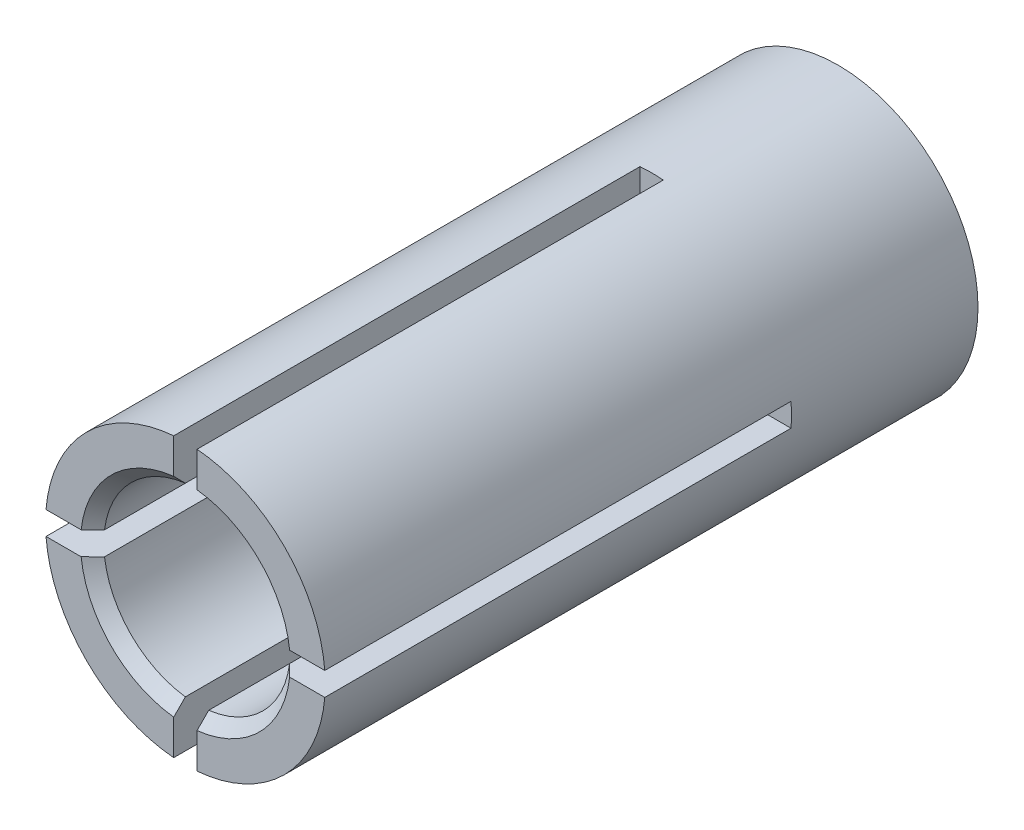
ISO-10303-21;
HEADER;
FILE_DESCRIPTION(('STEP AP214'),'2;1');
FILE_NAME('part.step','',(''),(''),'','','');
FILE_SCHEMA(('AUTOMOTIVE_DESIGN { 1 0 10303 214 1 1 1 1 }'));
ENDSEC;
DATA;
#1=APPLICATION_CONTEXT('core data for automotive mechanical design processes');
#2=APPLICATION_PROTOCOL_DEFINITION('international standard','automotive_design',2000,#1);
#3=PRODUCT_CONTEXT('',#1,'mechanical');
#4=PRODUCT('Part','Part','',(#3));
#5=PRODUCT_RELATED_PRODUCT_CATEGORY('part','',(#4));
#6=PRODUCT_DEFINITION_FORMATION('','',#4);
#7=PRODUCT_DEFINITION_CONTEXT('part definition',#1,'design');
#8=PRODUCT_DEFINITION('design','',#6,#7);
#9=PRODUCT_DEFINITION_SHAPE('','',#8);
#10=(LENGTH_UNIT() NAMED_UNIT(*) SI_UNIT(.MILLI.,.METRE.));
#11=(NAMED_UNIT(*) PLANE_ANGLE_UNIT() SI_UNIT($,.RADIAN.));
#12=(NAMED_UNIT(*) SI_UNIT($,.STERADIAN.) SOLID_ANGLE_UNIT());
#13=UNCERTAINTY_MEASURE_WITH_UNIT(LENGTH_MEASURE(1.E-05),#10,'distance_accuracy_value','');
#14=(GEOMETRIC_REPRESENTATION_CONTEXT(3) GLOBAL_UNCERTAINTY_ASSIGNED_CONTEXT((#13)) GLOBAL_UNIT_ASSIGNED_CONTEXT((#10,
#11,#12)) REPRESENTATION_CONTEXT('',''));
#15=CARTESIAN_POINT('',(0.,0.,0.));
#16=DIRECTION('',(0.,0.,1.));
#17=DIRECTION('',(1.,0.,0.));
#18=AXIS2_PLACEMENT_3D('',#15,#16,#17);
#19=CARTESIAN_POINT('',(0.,0.,14.));
#20=DIRECTION('',(0.,0.,1.));
#21=DIRECTION('',(1.,0.,0.));
#22=AXIS2_PLACEMENT_3D('',#19,#20,#21);
#23=PLANE('',#22);
#24=DIRECTION('',(1.,0.,0.));
#25=VECTOR('',#24,1.);
#26=CARTESIAN_POINT('',(2.98956518577535,-0.25,14.));
#27=LINE('',#26,#25);
#28=CARTESIAN_POINT('',(2.23606797749979,-0.25,14.));
#29=VERTEX_POINT('',#28);
#30=CARTESIAN_POINT('',(2.98956518577535,-0.25,14.));
#31=VERTEX_POINT('',#30);
#32=EDGE_CURVE('E189',#29,#31,#27,.T.);
#33=ORIENTED_EDGE('',*,*,#32,.F.);
#34=CARTESIAN_POINT('',(0.,0.,14.));
#35=DIRECTION('',(0.,0.,1.));
#36=DIRECTION('',(1.,0.,0.));
#37=AXIS2_PLACEMENT_3D('',#34,#35,#36);
#38=CIRCLE('',#37,2.25);
#39=CARTESIAN_POINT('',(0.25,-2.23606797749979,14.));
#40=VERTEX_POINT('',#39);
#41=EDGE_CURVE('E235',#29,#40,#38,.F.);
#42=ORIENTED_EDGE('',*,*,#41,.T.);
#43=DIRECTION('',(0.,1.,0.));
#44=VECTOR('',#43,1.);
#45=CARTESIAN_POINT('',(0.25,-0.25,14.));
#46=LINE('',#45,#44);
#47=CARTESIAN_POINT('',(0.250000000000002,-2.98956518577535,14.));
#48=VERTEX_POINT('',#47);
#49=EDGE_CURVE('E287',#48,#40,#46,.T.);
#50=ORIENTED_EDGE('',*,*,#49,.F.);
#51=CARTESIAN_POINT('',(0.,0.,14.));
#52=DIRECTION('',(0.,0.,1.));
#53=DIRECTION('',(1.,0.,0.));
#54=AXIS2_PLACEMENT_3D('',#51,#52,#53);
#55=CIRCLE('',#54,3.);
#56=EDGE_CURVE('E227',#48,#31,#55,.T.);
#57=ORIENTED_EDGE('',*,*,#56,.T.);
#58=EDGE_LOOP('',(#33,#42,#50,#57));
#59=FACE_BOUND('',#58,.T.);
#60=ADVANCED_FACE('F30',(#59),#23,.T.);
#61=DIRECTION('',(0.,-1.,0.));
#62=VECTOR('',#61,1.);
#63=CARTESIAN_POINT('',(-0.25,-0.25,14.));
#64=LINE('',#63,#62);
#65=CARTESIAN_POINT('',(-0.25,-2.23606797749979,14.));
#66=VERTEX_POINT('',#65);
#67=CARTESIAN_POINT('',(-0.25,-2.98956518577535,14.));
#68=VERTEX_POINT('',#67);
#69=EDGE_CURVE('E394',#66,#68,#64,.T.);
#70=ORIENTED_EDGE('',*,*,#69,.F.);
#71=CARTESIAN_POINT('',(-2.23606797749979,-0.25,14.));
#72=VERTEX_POINT('',#71);
#73=EDGE_CURVE('E239',#66,#72,#38,.F.);
#74=ORIENTED_EDGE('',*,*,#73,.T.);
#75=DIRECTION('',(1.,0.,0.));
#76=VECTOR('',#75,1.);
#77=CARTESIAN_POINT('',(-2.98956518577535,-0.25,14.));
#78=LINE('',#77,#76);
#79=CARTESIAN_POINT('',(-2.98956518577535,-0.249999999999999,14.));
#80=VERTEX_POINT('',#79);
#81=EDGE_CURVE('E392',#80,#72,#78,.T.);
#82=ORIENTED_EDGE('',*,*,#81,.F.);
#83=EDGE_CURVE('E434',#80,#68,#55,.T.);
#84=ORIENTED_EDGE('',*,*,#83,.T.);
#85=EDGE_LOOP('',(#70,#74,#82,#84));
#86=FACE_BOUND('',#85,.T.);
#87=ADVANCED_FACE('F275',(#86),#23,.T.);
#88=DIRECTION('',(-1.,0.,0.));
#89=VECTOR('',#88,1.);
#90=CARTESIAN_POINT('',(-2.98956518577535,0.249999999999998,14.));
#91=LINE('',#90,#89);
#92=CARTESIAN_POINT('',(-2.23606797749979,0.249999999999999,14.));
#93=VERTEX_POINT('',#92);
#94=CARTESIAN_POINT('',(-2.98956518577535,0.249999999999998,14.));
#95=VERTEX_POINT('',#94);
#96=EDGE_CURVE('E412',#93,#95,#91,.T.);
#97=ORIENTED_EDGE('',*,*,#96,.F.);
#98=CARTESIAN_POINT('',(-0.25,2.23606797749979,14.));
#99=VERTEX_POINT('',#98);
#100=EDGE_CURVE('E381',#93,#99,#38,.F.);
#101=ORIENTED_EDGE('',*,*,#100,.T.);
#102=DIRECTION('',(0.,-1.,0.));
#103=VECTOR('',#102,1.);
#104=CARTESIAN_POINT('',(-0.25,0.25,14.));
#105=LINE('',#104,#103);
#106=CARTESIAN_POINT('',(-0.25,2.98956518577535,14.));
#107=VERTEX_POINT('',#106);
#108=EDGE_CURVE('E415',#107,#99,#105,.T.);
#109=ORIENTED_EDGE('',*,*,#108,.F.);
#110=EDGE_CURVE('E226',#107,#95,#55,.T.);
#111=ORIENTED_EDGE('',*,*,#110,.T.);
#112=EDGE_LOOP('',(#97,#101,#109,#111));
#113=FACE_BOUND('',#112,.T.);
#114=ADVANCED_FACE('F268',(#113),#23,.T.);
#115=CARTESIAN_POINT('',(0.,0.,13.75));
#116=DIRECTION('',(0.,0.,1.));
#117=DIRECTION('',(1.,0.,0.));
#118=AXIS2_PLACEMENT_3D('',#115,#116,#117);
#119=CONICAL_SURFACE('',#118,2.,0.785398163397455);
#120=CARTESIAN_POINT('',(0.302741084224424,-0.25,12.1426221645264));
#121=CARTESIAN_POINT('',(0.317960453729847,-0.25,12.1543679730482));
#122=CARTESIAN_POINT('',(0.333014531848367,-0.25,12.1663229463904));
#123=CARTESIAN_POINT('',(0.36285792672978,-0.25,12.190554220147));
#124=CARTESIAN_POINT('',(0.377647290102898,-0.25,12.2028304630369));
#125=CARTESIAN_POINT('',(0.421711584192529,-0.25,12.2399907180696));
#126=CARTESIAN_POINT('',(0.450696505860516,-0.25,12.2652171671053));
#127=CARTESIAN_POINT('',(0.508176291730957,-0.25,12.3161879557759));
#128=CARTESIAN_POINT('',(0.5366714023152,-0.25,12.3419320200088));
#129=CARTESIAN_POINT('',(0.593351685196752,-0.25,12.3937670443241));
#130=CARTESIAN_POINT('',(0.621536809723744,-0.25,12.4198580565411));
#131=CARTESIAN_POINT('',(0.709452963884151,-0.25,12.5018997394878));
#132=CARTESIAN_POINT('',(0.768811177280419,-0.25,12.5582489591398));
#133=CARTESIAN_POINT('',(0.887045822918403,-0.25,12.6714511318724));
#134=CARTESIAN_POINT('',(0.945922240026668,-0.25,12.72830410066));
#135=CARTESIAN_POINT('',(1.12213731279967,-0.25,12.8992872007103));
#136=CARTESIAN_POINT('',(1.23906296186066,-0.25,13.013842641041));
#137=CARTESIAN_POINT('',(1.47257646545155,-0.25,13.2435090676362));
#138=CARTESIAN_POINT('',(1.58916391117353,-0.25,13.3586204674635));
#139=CARTESIAN_POINT('',(1.82209400881993,-0.25,13.5890861029974));
#140=CARTESIAN_POINT('',(1.9384366657381,-0.25,13.7044403336521));
#141=CARTESIAN_POINT('',(2.19822193413989,-0.25,13.9623251721432));
#142=CARTESIAN_POINT('',(2.34162858752974,-0.25,14.104891962737));
#143=CARTESIAN_POINT('',(2.62832290392371,-0.25,14.3901473591601));
#144=CARTESIAN_POINT('',(2.77161056599507,-0.25,14.5328359659267));
#145=CARTESIAN_POINT('',(3.05792402957366,-0.25,14.8181018736583));
#146=CARTESIAN_POINT('',(3.20094992869957,-0.25,14.9606790766729));
#147=CARTESIAN_POINT('',(3.48694883303794,-0.25,15.2458841152313));
#148=CARTESIAN_POINT('',(3.6299218386862,-0.25,15.3885119503382));
#149=CARTESIAN_POINT('',(3.77288046266891,-0.25,15.5311541869631));
#150=B_SPLINE_CURVE_WITH_KNOTS('',3,(#120,#121,#122,#123,#124,#125,#126,#127,#128,#129,#130,
#131,#132,#133,#134,#135,#136,#137,#138,#139,#140,#141,#142,#143,#144,#145,#146,#147,#148,#149),
.UNSPECIFIED.,.F.,.F.,(4,2,2,2,2,2,2,2,2,2,2,2,2,2,4),(0.,0.0576681378172349,0.115326019670359,
0.23058906804333,0.345792332639199,0.461013108618342,0.706541151172434,0.952076876502175,
1.44314347376522,1.93466102702139,2.42616845403975,3.03281229507879,3.63946084754579,
4.24531725391537,4.85116855206024),.UNSPECIFIED.);
#151=CARTESIAN_POINT('',(1.98431348329844,-0.25,13.75));
#152=VERTEX_POINT('',#151);
#153=EDGE_CURVE('E294',#152,#29,#150,.T.);
#154=ORIENTED_EDGE('',*,*,#153,.F.);
#155=CARTESIAN_POINT('',(0.,0.,13.75));
#156=DIRECTION('',(0.,0.,1.));
#157=DIRECTION('',(1.,0.,0.));
#158=AXIS2_PLACEMENT_3D('',#155,#156,#157);
#159=CIRCLE('',#158,2.);
#160=CARTESIAN_POINT('',(0.25,-1.98431348329844,13.75));
#161=VERTEX_POINT('',#160);
#162=EDGE_CURVE('E225',#161,#152,#159,.T.);
#163=ORIENTED_EDGE('',*,*,#162,.F.);
#164=CARTESIAN_POINT('',(0.25,-3.77288046266891,15.5311541869631));
#165=CARTESIAN_POINT('',(0.25,-3.62981802243947,15.3884085007871));
#166=CARTESIAN_POINT('',(0.25,-3.48674127796846,15.245677131242));
#167=CARTESIAN_POINT('',(0.25,-3.20054113992748,14.9602714322271));
#168=CARTESIAN_POINT('',(0.25,-3.05741774821332,14.8175971008963));
#169=CARTESIAN_POINT('',(0.25,-2.77111016330189,14.5323377376306));
#170=CARTESIAN_POINT('',(0.25,-2.62792597750641,14.3897526982675));
#171=CARTESIAN_POINT('',(0.25,-2.34143336691177,14.1046974507362));
#172=CARTESIAN_POINT('',(0.25,-2.19812493795967,13.9622272467398));
#173=CARTESIAN_POINT('',(0.25,-1.98298880509478,13.7486673764058));
#174=CARTESIAN_POINT('',(0.25,-1.91124050811756,13.6774977298582));
#175=CARTESIAN_POINT('',(0.25,-1.76767011833127,13.5352348752943));
#176=CARTESIAN_POINT('',(0.25,-1.69584802655194,13.464141666239));
#177=CARTESIAN_POINT('',(0.25,-1.55210436650431,13.3220711612731));
#178=CARTESIAN_POINT('',(0.25,-1.48018280965929,13.2510938538114));
#179=CARTESIAN_POINT('',(0.25,-1.33617309257203,13.1093013228982));
#180=CARTESIAN_POINT('',(0.25,-1.2640849242968,13.0384861076038));
#181=CARTESIAN_POINT('',(0.25,-1.11962163137609,12.8970953300996));
#182=CARTESIAN_POINT('',(0.25,-1.04724641128778,12.8265198651804));
#183=CARTESIAN_POINT('',(0.25,-0.938335808618407,12.7210277003167));
#184=CARTESIAN_POINT('',(0.25,-0.90197738080137,12.6859284166719));
#185=CARTESIAN_POINT('',(0.25,-0.829090459358274,12.6159028370612));
#186=CARTESIAN_POINT('',(0.25,-0.792561957067124,12.5809765501007));
#187=CARTESIAN_POINT('',(0.25,-0.719238707395647,12.5113617459312));
#188=CARTESIAN_POINT('',(0.25,-0.682443818330706,12.4766733778196));
#189=CARTESIAN_POINT('',(0.25,-0.608484016046663,12.4077018126905));
#190=CARTESIAN_POINT('',(0.25,-0.57131915658067,12.3734185583522));
#191=CARTESIAN_POINT('',(0.25,-0.51508999379516,12.3224993377492));
#192=CARTESIAN_POINT('',(0.25,-0.496260183651158,12.3056049183895));
#193=CARTESIAN_POINT('',(0.25,-0.458389334451682,12.2720572281331));
#194=CARTESIAN_POINT('',(0.25,-0.439348311762073,12.2554039387796));
#195=CARTESIAN_POINT('',(0.25,-0.400970972219268,12.2224183848648));
#196=CARTESIAN_POINT('',(0.25,-0.381634510005532,12.206086288006));
#197=CARTESIAN_POINT('',(0.25,-0.342537743825695,12.1739281736697));
#198=CARTESIAN_POINT('',(0.25,-0.32277732694518,12.1581022938832));
#199=CARTESIAN_POINT('',(0.25,-0.302741084224424,12.1426221645264));
#200=B_SPLINE_CURVE_WITH_KNOTS('',3,(#164,#165,#166,#167,#168,#169,#170,#171,#172,#173,#174,
#175,#176,#177,#178,#179,#180,#181,#182,#183,#184,#185,#186,#187,#188,#189,#190,#191,#192,#193,
#194,#195,#196,#197,#198,#199),.UNSPECIFIED.,.F.,.F.,(4,2,2,2,2,2,2,2,2,2,2,2,2,2,2,2,2,4),(0.,
0.606290986171906,1.21256024144211,1.81876961421285,2.42500009807164,2.72817728399238,
3.03135029532569,3.33449098070736,3.63764660000146,3.94091326932693,4.09252113778145,
4.24413681689769,4.39584012888943,4.5475217125328,4.62341380562543,4.69930005871457,
4.77522493487536,4.85117028995729),.UNSPECIFIED.);
#201=EDGE_CURVE('E296',#40,#161,#200,.T.);
#202=ORIENTED_EDGE('',*,*,#201,.F.);
#203=ORIENTED_EDGE('',*,*,#41,.F.);
#204=EDGE_LOOP('',(#154,#163,#202,#203));
#205=FACE_BOUND('',#204,.T.);
#206=ADVANCED_FACE('F292',(#205),#119,.F.);
#207=CARTESIAN_POINT('',(-0.25,-0.302741084224424,12.1426221645264));
#208=CARTESIAN_POINT('',(-0.25,-0.317960453729847,12.1543679730482));
#209=CARTESIAN_POINT('',(-0.25,-0.333014531848367,12.1663229463904));
#210=CARTESIAN_POINT('',(-0.25,-0.36285792672978,12.190554220147));
#211=CARTESIAN_POINT('',(-0.25,-0.377647290102898,12.2028304630369));
#212=CARTESIAN_POINT('',(-0.25,-0.421711584192529,12.2399907180696));
#213=CARTESIAN_POINT('',(-0.25,-0.450696505860515,12.2652171671053));
#214=CARTESIAN_POINT('',(-0.25,-0.508176291730958,12.3161879557759));
#215=CARTESIAN_POINT('',(-0.25,-0.536671402315201,12.3419320200088));
#216=CARTESIAN_POINT('',(-0.25,-0.593351685196753,12.3937670443241));
#217=CARTESIAN_POINT('',(-0.25,-0.621536809723744,12.4198580565411));
#218=CARTESIAN_POINT('',(-0.25,-0.70945296388415,12.5018997394878));
#219=CARTESIAN_POINT('',(-0.25,-0.768811177280418,12.5582489591398));
#220=CARTESIAN_POINT('',(-0.25,-0.887045822918402,12.6714511318724));
#221=CARTESIAN_POINT('',(-0.25,-0.945922240026668,12.72830410066));
#222=CARTESIAN_POINT('',(-0.25,-1.12213731279967,12.8992872007103));
#223=CARTESIAN_POINT('',(-0.25,-1.23906296186066,13.013842641041));
#224=CARTESIAN_POINT('',(-0.25,-1.47257646545154,13.2435090676362));
#225=CARTESIAN_POINT('',(-0.25,-1.58916391117353,13.3586204674635));
#226=CARTESIAN_POINT('',(-0.25,-1.82209400881993,13.5890861029974));
#227=CARTESIAN_POINT('',(-0.25,-1.9384366657381,13.7044403336521));
#228=CARTESIAN_POINT('',(-0.25,-2.19822193413989,13.9623251721432));
#229=CARTESIAN_POINT('',(-0.25,-2.34162858752974,14.104891962737));
#230=CARTESIAN_POINT('',(-0.25,-2.62832290392371,14.3901473591601));
#231=CARTESIAN_POINT('',(-0.25,-2.77161056599507,14.5328359659267));
#232=CARTESIAN_POINT('',(-0.25,-3.05792402957366,14.8181018736583));
#233=CARTESIAN_POINT('',(-0.25,-3.20094992869957,14.9606790766729));
#234=CARTESIAN_POINT('',(-0.25,-3.48694883303794,15.2458841152313));
#235=CARTESIAN_POINT('',(-0.25,-3.6299218386862,15.3885119503382));
#236=CARTESIAN_POINT('',(-0.25,-3.77288046266891,15.5311541869631));
#237=B_SPLINE_CURVE_WITH_KNOTS('',3,(#207,#208,#209,#210,#211,#212,#213,#214,#215,#216,#217,
#218,#219,#220,#221,#222,#223,#224,#225,#226,#227,#228,#229,#230,#231,#232,#233,#234,#235,#236),
.UNSPECIFIED.,.F.,.F.,(4,2,2,2,2,2,2,2,2,2,2,2,2,2,4),(0.,0.0576681378172349,0.115326019670359,
0.23058906804333,0.345792332639199,0.461013108618342,0.706541151172433,0.952076876502175,
1.44314347376522,1.93466102702139,2.42616845403975,3.03281229507879,3.63946084754579,
4.24531725391537,4.85116855206024),.UNSPECIFIED.);
#238=CARTESIAN_POINT('',(-0.25,-1.98431348329844,13.75));
#239=VERTEX_POINT('',#238);
#240=EDGE_CURVE('E299',#239,#66,#237,.T.);
#241=ORIENTED_EDGE('',*,*,#240,.F.);
#242=CARTESIAN_POINT('',(-1.98431348329844,-0.25,13.75));
#243=VERTEX_POINT('',#242);
#244=EDGE_CURVE('E400',#243,#239,#159,.T.);
#245=ORIENTED_EDGE('',*,*,#244,.F.);
#246=CARTESIAN_POINT('',(-3.77288046266891,-0.25,15.5311541869631));
#247=CARTESIAN_POINT('',(-3.62981802243947,-0.25,15.3884085007871));
#248=CARTESIAN_POINT('',(-3.48674127796846,-0.25,15.245677131242));
#249=CARTESIAN_POINT('',(-3.20054113992748,-0.25,14.9602714322271));
#250=CARTESIAN_POINT('',(-3.05741774821332,-0.25,14.8175971008962));
#251=CARTESIAN_POINT('',(-2.77111016330189,-0.25,14.5323377376306));
#252=CARTESIAN_POINT('',(-2.6279259775064,-0.25,14.3897526982675));
#253=CARTESIAN_POINT('',(-2.34143336691176,-0.25,14.1046974507362));
#254=CARTESIAN_POINT('',(-2.19812493795967,-0.25,13.9622272467398));
#255=CARTESIAN_POINT('',(-1.98298880509478,-0.25,13.7486673764058));
#256=CARTESIAN_POINT('',(-1.91124050811756,-0.25,13.6774977298582));
#257=CARTESIAN_POINT('',(-1.76767011833127,-0.25,13.5352348752943));
#258=CARTESIAN_POINT('',(-1.69584802655194,-0.25,13.464141666239));
#259=CARTESIAN_POINT('',(-1.55210436650431,-0.25,13.3220711612731));
#260=CARTESIAN_POINT('',(-1.48018280965929,-0.25,13.2510938538114));
#261=CARTESIAN_POINT('',(-1.33617309257203,-0.25,13.1093013228982));
#262=CARTESIAN_POINT('',(-1.2640849242968,-0.25,13.0384861076038));
#263=CARTESIAN_POINT('',(-1.11962163137609,-0.25,12.8970953300996));
#264=CARTESIAN_POINT('',(-1.04724641128778,-0.25,12.8265198651804));
#265=CARTESIAN_POINT('',(-0.938335808618407,-0.25,12.7210277003167));
#266=CARTESIAN_POINT('',(-0.901977380801369,-0.25,12.6859284166719));
#267=CARTESIAN_POINT('',(-0.829090459358274,-0.25,12.6159028370612));
#268=CARTESIAN_POINT('',(-0.792561957067124,-0.25,12.5809765501007));
#269=CARTESIAN_POINT('',(-0.719238707395648,-0.25,12.5113617459312));
#270=CARTESIAN_POINT('',(-0.682443818330707,-0.25,12.4766733778196));
#271=CARTESIAN_POINT('',(-0.608484016046665,-0.25,12.4077018126905));
#272=CARTESIAN_POINT('',(-0.571319156580671,-0.25,12.3734185583522));
#273=CARTESIAN_POINT('',(-0.515089993795162,-0.25,12.3224993377492));
#274=CARTESIAN_POINT('',(-0.496260183651158,-0.25,12.3056049183895));
#275=CARTESIAN_POINT('',(-0.458389334451683,-0.25,12.2720572281331));
#276=CARTESIAN_POINT('',(-0.439348311762074,-0.25,12.2554039387796));
#277=CARTESIAN_POINT('',(-0.40097097221927,-0.25,12.2224183848648));
#278=CARTESIAN_POINT('',(-0.381634510005534,-0.25,12.2060862880061));
#279=CARTESIAN_POINT('',(-0.342537743825697,-0.25,12.1739281736697));
#280=CARTESIAN_POINT('',(-0.322777326945181,-0.25,12.1581022938832));
#281=CARTESIAN_POINT('',(-0.302741084224424,-0.25,12.1426221645264));
#282=B_SPLINE_CURVE_WITH_KNOTS('',3,(#246,#247,#248,#249,#250,#251,#252,#253,#254,#255,#256,
#257,#258,#259,#260,#261,#262,#263,#264,#265,#266,#267,#268,#269,#270,#271,#272,#273,#274,#275,
#276,#277,#278,#279,#280,#281),.UNSPECIFIED.,.F.,.F.,(4,2,2,2,2,2,2,2,2,2,2,2,2,2,2,2,2,4),(0.,
0.606290986171907,1.21256024144211,1.81876961421285,2.42500009807164,2.72817728399238,
3.03135029532568,3.33449098070736,3.63764660000146,3.94091326932692,4.09252113778145,
4.24413681689769,4.39584012888943,4.54752171253279,4.62341380562543,4.69930005871457,
4.77522493487535,4.85117028995728),.UNSPECIFIED.);
#283=EDGE_CURVE('E301',#72,#243,#282,.T.);
#284=ORIENTED_EDGE('',*,*,#283,.F.);
#285=ORIENTED_EDGE('',*,*,#73,.F.);
#286=EDGE_LOOP('',(#241,#245,#284,#285));
#287=FACE_BOUND('',#286,.T.);
#288=ADVANCED_FACE('F397',(#287),#119,.F.);
#289=CARTESIAN_POINT('',(-0.302741084224424,0.25,12.1426221645264));
#290=CARTESIAN_POINT('',(-0.317960453729848,0.25,12.1543679730482));
#291=CARTESIAN_POINT('',(-0.333014531848367,0.25,12.1663229463904));
#292=CARTESIAN_POINT('',(-0.362857926729781,0.25,12.190554220147));
#293=CARTESIAN_POINT('',(-0.3776472901029,0.25,12.2028304630369));
#294=CARTESIAN_POINT('',(-0.42171158419253,0.25,12.2399907180696));
#295=CARTESIAN_POINT('',(-0.450696505860517,0.25,12.2652171671053));
#296=CARTESIAN_POINT('',(-0.508176291730959,0.25,12.3161879557759));
#297=CARTESIAN_POINT('',(-0.536671402315202,0.25,12.3419320200088));
#298=CARTESIAN_POINT('',(-0.593351685196754,0.25,12.3937670443241));
#299=CARTESIAN_POINT('',(-0.621536809723745,0.25,12.4198580565411));
#300=CARTESIAN_POINT('',(-0.709452963884151,0.25,12.5018997394878));
#301=CARTESIAN_POINT('',(-0.768811177280419,0.25,12.5582489591398));
#302=CARTESIAN_POINT('',(-0.887045822918403,0.249999999999999,12.6714511318724));
#303=CARTESIAN_POINT('',(-0.945922240026669,0.249999999999999,12.72830410066));
#304=CARTESIAN_POINT('',(-1.12213731279967,0.249999999999999,12.8992872007103));
#305=CARTESIAN_POINT('',(-1.23906296186066,0.249999999999999,13.013842641041));
#306=CARTESIAN_POINT('',(-1.47257646545154,0.249999999999999,13.2435090676362));
#307=CARTESIAN_POINT('',(-1.58916391117353,0.249999999999999,13.3586204674635));
#308=CARTESIAN_POINT('',(-1.82209400881993,0.249999999999999,13.5890861029974));
#309=CARTESIAN_POINT('',(-1.9384366657381,0.249999999999999,13.7044403336521));
#310=CARTESIAN_POINT('',(-2.19822193413989,0.249999999999999,13.9623251721432));
#311=CARTESIAN_POINT('',(-2.34162858752973,0.249999999999999,14.104891962737));
#312=CARTESIAN_POINT('',(-2.62832290392371,0.249999999999998,14.3901473591601));
#313=CARTESIAN_POINT('',(-2.77161056599507,0.249999999999998,14.5328359659267));
#314=CARTESIAN_POINT('',(-3.05792402957366,0.249999999999998,14.8181018736583));
#315=CARTESIAN_POINT('',(-3.20094992869957,0.249999999999998,14.9606790766729));
#316=CARTESIAN_POINT('',(-3.48694883303793,0.249999999999998,15.2458841152313));
#317=CARTESIAN_POINT('',(-3.6299218386862,0.249999999999998,15.3885119503382));
#318=CARTESIAN_POINT('',(-3.77288046266891,0.249999999999998,15.5311541869631));
#319=B_SPLINE_CURVE_WITH_KNOTS('',3,(#289,#290,#291,#292,#293,#294,#295,#296,#297,#298,#299,
#300,#301,#302,#303,#304,#305,#306,#307,#308,#309,#310,#311,#312,#313,#314,#315,#316,#317,#318),
.UNSPECIFIED.,.F.,.F.,(4,2,2,2,2,2,2,2,2,2,2,2,2,2,4),(0.,0.0576681378172349,0.115326019670361,
0.230589068043331,0.345792332639199,0.461013108618343,0.706541151172433,0.952076876502175,
1.44314347376522,1.93466102702138,2.42616845403975,3.03281229507879,3.63946084754578,
4.24531725391537,4.85116855206023),.UNSPECIFIED.);
#320=CARTESIAN_POINT('',(-1.98431348329844,0.249999999999999,13.75));
#321=VERTEX_POINT('',#320);
#322=EDGE_CURVE('E338',#321,#93,#319,.T.);
#323=ORIENTED_EDGE('',*,*,#322,.F.);
#324=CARTESIAN_POINT('',(-0.25,1.98431348329844,13.75));
#325=VERTEX_POINT('',#324);
#326=EDGE_CURVE('E234',#325,#321,#159,.T.);
#327=ORIENTED_EDGE('',*,*,#326,.F.);
#328=CARTESIAN_POINT('',(-0.25,3.77288046266891,15.5311541869631));
#329=CARTESIAN_POINT('',(-0.25,3.62981802243947,15.3884085007871));
#330=CARTESIAN_POINT('',(-0.25,3.48674127796846,15.245677131242));
#331=CARTESIAN_POINT('',(-0.25,3.20054113992748,14.9602714322271));
#332=CARTESIAN_POINT('',(-0.25,3.05741774821332,14.8175971008962));
#333=CARTESIAN_POINT('',(-0.25,2.77111016330189,14.5323377376306));
#334=CARTESIAN_POINT('',(-0.25,2.6279259775064,14.3897526982675));
#335=CARTESIAN_POINT('',(-0.25,2.34143336691176,14.1046974507362));
#336=CARTESIAN_POINT('',(-0.25,2.19812493795967,13.9622272467398));
#337=CARTESIAN_POINT('',(-0.25,1.98298880509478,13.7486673764058));
#338=CARTESIAN_POINT('',(-0.25,1.91124050811756,13.6774977298582));
#339=CARTESIAN_POINT('',(-0.25,1.76767011833127,13.5352348752943));
#340=CARTESIAN_POINT('',(-0.25,1.69584802655194,13.464141666239));
#341=CARTESIAN_POINT('',(-0.25,1.55210436650431,13.3220711612731));
#342=CARTESIAN_POINT('',(-0.25,1.48018280965929,13.2510938538114));
#343=CARTESIAN_POINT('',(-0.25,1.33617309257203,13.1093013228982));
#344=CARTESIAN_POINT('',(-0.25,1.2640849242968,13.0384861076038));
#345=CARTESIAN_POINT('',(-0.25,1.11962163137609,12.8970953300996));
#346=CARTESIAN_POINT('',(-0.25,1.04724641128778,12.8265198651804));
#347=CARTESIAN_POINT('',(-0.25,0.938335808618407,12.7210277003167));
#348=CARTESIAN_POINT('',(-0.25,0.901977380801369,12.6859284166719));
#349=CARTESIAN_POINT('',(-0.25,0.829090459358274,12.6159028370612));
#350=CARTESIAN_POINT('',(-0.25,0.792561957067124,12.5809765501007));
#351=CARTESIAN_POINT('',(-0.25,0.719238707395648,12.5113617459312));
#352=CARTESIAN_POINT('',(-0.25,0.682443818330707,12.4766733778196));
#353=CARTESIAN_POINT('',(-0.25,0.608484016046665,12.4077018126905));
#354=CARTESIAN_POINT('',(-0.25,0.571319156580672,12.3734185583522));
#355=CARTESIAN_POINT('',(-0.25,0.515089993795162,12.3224993377492));
#356=CARTESIAN_POINT('',(-0.25,0.496260183651158,12.3056049183895));
#357=CARTESIAN_POINT('',(-0.25,0.458389334451682,12.2720572281331));
#358=CARTESIAN_POINT('',(-0.25,0.439348311762074,12.2554039387796));
#359=CARTESIAN_POINT('',(-0.25,0.40097097221927,12.2224183848648));
#360=CARTESIAN_POINT('',(-0.25,0.381634510005534,12.2060862880061));
#361=CARTESIAN_POINT('',(-0.25,0.342537743825697,12.1739281736697));
#362=CARTESIAN_POINT('',(-0.25,0.322777326945181,12.1581022938832));
#363=CARTESIAN_POINT('',(-0.25,0.302741084224424,12.1426221645264));
#364=B_SPLINE_CURVE_WITH_KNOTS('',3,(#328,#329,#330,#331,#332,#333,#334,#335,#336,#337,#338,
#339,#340,#341,#342,#343,#344,#345,#346,#347,#348,#349,#350,#351,#352,#353,#354,#355,#356,#357,
#358,#359,#360,#361,#362,#363),.UNSPECIFIED.,.F.,.F.,(4,2,2,2,2,2,2,2,2,2,2,2,2,2,2,2,2,4),(0.,
0.606290986171907,1.21256024144211,1.81876961421285,2.42500009807164,2.72817728399238,
3.03135029532568,3.33449098070736,3.63764660000146,3.94091326932692,4.09252113778145,
4.24413681689769,4.39584012888943,4.54752171253279,4.62341380562542,4.69930005871457,
4.77522493487536,4.85117028995728),.UNSPECIFIED.);
#365=EDGE_CURVE('E342',#99,#325,#364,.T.);
#366=ORIENTED_EDGE('',*,*,#365,.F.);
#367=ORIENTED_EDGE('',*,*,#100,.F.);
#368=EDGE_LOOP('',(#323,#327,#366,#367));
#369=FACE_BOUND('',#368,.T.);
#370=ADVANCED_FACE('F266',(#369),#119,.F.);
#371=DIRECTION('',(0.,1.,0.));
#372=VECTOR('',#371,1.);
#373=CARTESIAN_POINT('',(0.25,2.98956518577535,14.));
#374=LINE('',#373,#372);
#375=CARTESIAN_POINT('',(0.25,2.23606797749979,14.));
#376=VERTEX_POINT('',#375);
#377=CARTESIAN_POINT('',(0.25,2.98956518577535,14.));
#378=VERTEX_POINT('',#377);
#379=EDGE_CURVE('E418',#376,#378,#374,.T.);
#380=ORIENTED_EDGE('',*,*,#379,.F.);
#381=CARTESIAN_POINT('',(2.23606797749979,0.25,14.));
#382=VERTEX_POINT('',#381);
#383=EDGE_CURVE('E233',#376,#382,#38,.F.);
#384=ORIENTED_EDGE('',*,*,#383,.T.);
#385=DIRECTION('',(-1.,0.,0.));
#386=VECTOR('',#385,1.);
#387=CARTESIAN_POINT('',(0.25,0.25,14.));
#388=LINE('',#387,#386);
#389=CARTESIAN_POINT('',(2.98956518577535,0.25,14.));
#390=VERTEX_POINT('',#389);
#391=EDGE_CURVE('E450',#390,#382,#388,.T.);
#392=ORIENTED_EDGE('',*,*,#391,.F.);
#393=EDGE_CURVE('E197',#390,#378,#55,.T.);
#394=ORIENTED_EDGE('',*,*,#393,.T.);
#395=EDGE_LOOP('',(#380,#384,#392,#394));
#396=FACE_BOUND('',#395,.T.);
#397=ADVANCED_FACE('F262',(#396),#23,.T.);
#398=CARTESIAN_POINT('',(0.,0.,0.));
#399=DIRECTION('',(0.,0.,1.));
#400=DIRECTION('',(1.,0.,0.));
#401=AXIS2_PLACEMENT_3D('',#398,#399,#400);
#402=PLANE('',#401);
#403=CARTESIAN_POINT('',(0.,0.,0.));
#404=DIRECTION('',(0.,0.,1.));
#405=DIRECTION('',(1.,0.,0.));
#406=AXIS2_PLACEMENT_3D('',#403,#404,#405);
#407=CIRCLE('',#406,3.);
#408=CARTESIAN_POINT('',(3.,0.,0.));
#409=VERTEX_POINT('',#408);
#410=EDGE_CURVE('E223',#409,#409,#407,.T.);
#411=ORIENTED_EDGE('',*,*,#410,.F.);
#412=EDGE_LOOP('',(#411));
#413=FACE_BOUND('',#412,.T.);
#414=CARTESIAN_POINT('',(0.,0.,0.));
#415=DIRECTION('',(0.,0.,1.));
#416=DIRECTION('',(1.,0.,0.));
#417=AXIS2_PLACEMENT_3D('',#414,#415,#416);
#418=CIRCLE('',#417,2.);
#419=CARTESIAN_POINT('',(2.,0.,0.));
#420=VERTEX_POINT('',#419);
#421=EDGE_CURVE('E220',#420,#420,#418,.T.);
#422=ORIENTED_EDGE('',*,*,#421,.T.);
#423=EDGE_LOOP('',(#422));
#424=FACE_BOUND('',#423,.T.);
#425=ADVANCED_FACE('F265',(#413,#424),#402,.F.);
#426=CARTESIAN_POINT('',(0.,0.,14.));
#427=DIRECTION('',(0.,0.,-1.));
#428=DIRECTION('',(-1.,0.,0.));
#429=AXIS2_PLACEMENT_3D('',#426,#427,#428);
#430=CYLINDRICAL_SURFACE('',#429,3.);
#431=ORIENTED_EDGE('',*,*,#110,.F.);
#432=DIRECTION('',(0.,0.,1.));
#433=VECTOR('',#432,1.);
#434=CARTESIAN_POINT('',(-0.25,2.98956518577535,4.));
#435=LINE('',#434,#433);
#436=CARTESIAN_POINT('',(-0.25,2.98956518577535,4.));
#437=VERTEX_POINT('',#436);
#438=EDGE_CURVE('E200',#437,#107,#435,.T.);
#439=ORIENTED_EDGE('',*,*,#438,.F.);
#440=CARTESIAN_POINT('',(0.,0.,4.));
#441=DIRECTION('',(0.,0.,1.));
#442=DIRECTION('',(-1.,0.,0.));
#443=AXIS2_PLACEMENT_3D('',#440,#441,#442);
#444=CIRCLE('',#443,3.);
#445=CARTESIAN_POINT('',(0.25,2.98956518577535,4.));
#446=VERTEX_POINT('',#445);
#447=EDGE_CURVE('E367',#446,#437,#444,.T.);
#448=ORIENTED_EDGE('',*,*,#447,.F.);
#449=DIRECTION('',(0.,0.,1.));
#450=VECTOR('',#449,1.);
#451=CARTESIAN_POINT('',(0.25,2.98956518577535,4.));
#452=LINE('',#451,#450);
#453=EDGE_CURVE('E198',#446,#378,#452,.T.);
#454=ORIENTED_EDGE('',*,*,#453,.T.);
#455=ORIENTED_EDGE('',*,*,#393,.F.);
#456=DIRECTION('',(0.,0.,1.));
#457=VECTOR('',#456,1.);
#458=CARTESIAN_POINT('',(2.98956518577535,0.25,4.));
#459=LINE('',#458,#457);
#460=CARTESIAN_POINT('',(2.98956518577535,0.25,4.));
#461=VERTEX_POINT('',#460);
#462=EDGE_CURVE('E173',#461,#390,#459,.T.);
#463=ORIENTED_EDGE('',*,*,#462,.F.);
#464=CARTESIAN_POINT('',(0.,0.,4.));
#465=DIRECTION('',(0.,0.,1.));
#466=DIRECTION('',(-1.,0.,0.));
#467=AXIS2_PLACEMENT_3D('',#464,#465,#466);
#468=CIRCLE('',#467,3.);
#469=CARTESIAN_POINT('',(2.98956518577535,-0.25,4.));
#470=VERTEX_POINT('',#469);
#471=EDGE_CURVE('E180',#470,#461,#468,.T.);
#472=ORIENTED_EDGE('',*,*,#471,.F.);
#473=DIRECTION('',(0.,0.,1.));
#474=VECTOR('',#473,1.);
#475=CARTESIAN_POINT('',(2.98956518577535,-0.25,4.));
#476=LINE('',#475,#474);
#477=EDGE_CURVE('E208',#470,#31,#476,.T.);
#478=ORIENTED_EDGE('',*,*,#477,.T.);
#479=ORIENTED_EDGE('',*,*,#56,.F.);
#480=DIRECTION('',(0.,0.,1.));
#481=VECTOR('',#480,1.);
#482=CARTESIAN_POINT('',(0.250000000000002,-2.98956518577535,4.));
#483=LINE('',#482,#481);
#484=CARTESIAN_POINT('',(0.250000000000002,-2.98956518577535,4.));
#485=VERTEX_POINT('',#484);
#486=EDGE_CURVE('E425',#485,#48,#483,.T.);
#487=ORIENTED_EDGE('',*,*,#486,.F.);
#488=CARTESIAN_POINT('',(0.,0.,4.));
#489=DIRECTION('',(0.,0.,1.));
#490=DIRECTION('',(-1.,0.,0.));
#491=AXIS2_PLACEMENT_3D('',#488,#489,#490);
#492=CIRCLE('',#491,3.);
#493=CARTESIAN_POINT('',(-0.25,-2.98956518577535,4.));
#494=VERTEX_POINT('',#493);
#495=EDGE_CURVE('E440',#494,#485,#492,.T.);
#496=ORIENTED_EDGE('',*,*,#495,.F.);
#497=DIRECTION('',(0.,0.,1.));
#498=VECTOR('',#497,1.);
#499=CARTESIAN_POINT('',(-0.25,-2.98956518577535,4.));
#500=LINE('',#499,#498);
#501=EDGE_CURVE('E427',#494,#68,#500,.T.);
#502=ORIENTED_EDGE('',*,*,#501,.T.);
#503=ORIENTED_EDGE('',*,*,#83,.F.);
#504=DIRECTION('',(0.,0.,1.));
#505=VECTOR('',#504,1.);
#506=CARTESIAN_POINT('',(-2.98956518577535,-0.249999999999999,4.));
#507=LINE('',#506,#505);
#508=CARTESIAN_POINT('',(-2.98956518577535,-0.249999999999999,4.));
#509=VERTEX_POINT('',#508);
#510=EDGE_CURVE('E430',#509,#80,#507,.T.);
#511=ORIENTED_EDGE('',*,*,#510,.F.);
#512=CARTESIAN_POINT('',(0.,0.,4.));
#513=DIRECTION('',(0.,0.,1.));
#514=DIRECTION('',(-1.,0.,0.));
#515=AXIS2_PLACEMENT_3D('',#512,#513,#514);
#516=CIRCLE('',#515,3.);
#517=CARTESIAN_POINT('',(-2.98956518577535,0.249999999999998,4.));
#518=VERTEX_POINT('',#517);
#519=EDGE_CURVE('E445',#518,#509,#516,.T.);
#520=ORIENTED_EDGE('',*,*,#519,.F.);
#521=DIRECTION('',(0.,0.,1.));
#522=VECTOR('',#521,1.);
#523=CARTESIAN_POINT('',(-2.98956518577535,0.249999999999998,4.));
#524=LINE('',#523,#522);
#525=EDGE_CURVE('E432',#518,#95,#524,.T.);
#526=ORIENTED_EDGE('',*,*,#525,.T.);
#527=EDGE_LOOP('',(#431,#439,#448,#454,#455,#463,#472,#478,#479,#487,#496,#502,#503,#511,#520,#526));
#528=FACE_BOUND('',#527,.T.);
#529=ORIENTED_EDGE('',*,*,#410,.T.);
#530=EDGE_LOOP('',(#529));
#531=FACE_BOUND('',#530,.T.);
#532=ADVANCED_FACE('F193',(#528,#531),#430,.T.);
#533=CARTESIAN_POINT('',(0.,0.,14.));
#534=DIRECTION('',(0.,0.,-1.));
#535=DIRECTION('',(-1.,0.,0.));
#536=AXIS2_PLACEMENT_3D('',#533,#534,#535);
#537=CYLINDRICAL_SURFACE('',#536,2.);
#538=DIRECTION('',(0.,0.,-1.));
#539=VECTOR('',#538,1.);
#540=CARTESIAN_POINT('',(-0.25,1.98431348329844,14.));
#541=LINE('',#540,#539);
#542=CARTESIAN_POINT('',(-0.25,1.98431348329844,4.));
#543=VERTEX_POINT('',#542);
#544=EDGE_CURVE('E210',#325,#543,#541,.T.);
#545=ORIENTED_EDGE('',*,*,#544,.F.);
#546=ORIENTED_EDGE('',*,*,#326,.T.);
#547=DIRECTION('',(0.,0.,-1.));
#548=VECTOR('',#547,1.);
#549=CARTESIAN_POINT('',(-1.98431348329844,0.249999999999999,14.));
#550=LINE('',#549,#548);
#551=CARTESIAN_POINT('',(-1.98431348329844,0.249999999999999,4.));
#552=VERTEX_POINT('',#551);
#553=EDGE_CURVE('E55',#552,#321,#550,.F.);
#554=ORIENTED_EDGE('',*,*,#553,.F.);
#555=CARTESIAN_POINT('',(0.,0.,4.));
#556=DIRECTION('',(0.,0.,-1.));
#557=DIRECTION('',(-1.,0.,0.));
#558=AXIS2_PLACEMENT_3D('',#555,#556,#557);
#559=CIRCLE('',#558,2.);
#560=CARTESIAN_POINT('',(-1.98431348329844,-0.25,4.));
#561=VERTEX_POINT('',#560);
#562=EDGE_CURVE('E35',#561,#552,#559,.T.);
#563=ORIENTED_EDGE('',*,*,#562,.F.);
#564=DIRECTION('',(0.,0.,-1.));
#565=VECTOR('',#564,1.);
#566=CARTESIAN_POINT('',(-1.98431348329844,-0.25,14.));
#567=LINE('',#566,#565);
#568=EDGE_CURVE('E213',#243,#561,#567,.T.);
#569=ORIENTED_EDGE('',*,*,#568,.F.);
#570=ORIENTED_EDGE('',*,*,#244,.T.);
#571=DIRECTION('',(0.,0.,-1.));
#572=VECTOR('',#571,1.);
#573=CARTESIAN_POINT('',(-0.25,-1.98431348329844,14.));
#574=LINE('',#573,#572);
#575=CARTESIAN_POINT('',(-0.25,-1.98431348329844,4.));
#576=VERTEX_POINT('',#575);
#577=EDGE_CURVE('E47',#576,#239,#574,.F.);
#578=ORIENTED_EDGE('',*,*,#577,.F.);
#579=CARTESIAN_POINT('',(0.25,-1.98431348329844,4.));
#580=VERTEX_POINT('',#579);
#581=EDGE_CURVE('E405',#580,#576,#559,.T.);
#582=ORIENTED_EDGE('',*,*,#581,.F.);
#583=DIRECTION('',(0.,0.,-1.));
#584=VECTOR('',#583,1.);
#585=CARTESIAN_POINT('',(0.25,-1.98431348329844,14.));
#586=LINE('',#585,#584);
#587=EDGE_CURVE('E216',#161,#580,#586,.T.);
#588=ORIENTED_EDGE('',*,*,#587,.F.);
#589=ORIENTED_EDGE('',*,*,#162,.T.);
#590=DIRECTION('',(0.,0.,-1.));
#591=VECTOR('',#590,1.);
#592=CARTESIAN_POINT('',(1.98431348329844,-0.25,14.));
#593=LINE('',#592,#591);
#594=CARTESIAN_POINT('',(1.98431348329844,-0.25,4.));
#595=VERTEX_POINT('',#594);
#596=EDGE_CURVE('E218',#595,#152,#593,.F.);
#597=ORIENTED_EDGE('',*,*,#596,.F.);
#598=CARTESIAN_POINT('',(1.98431348329844,0.25,4.));
#599=VERTEX_POINT('',#598);
#600=EDGE_CURVE('E40',#599,#595,#559,.T.);
#601=ORIENTED_EDGE('',*,*,#600,.F.);
#602=DIRECTION('',(0.,0.,-1.));
#603=VECTOR('',#602,1.);
#604=CARTESIAN_POINT('',(1.98431348329844,0.25,14.));
#605=LINE('',#604,#603);
#606=CARTESIAN_POINT('',(1.98431348329844,0.25,13.75));
#607=VERTEX_POINT('',#606);
#608=EDGE_CURVE('E176',#607,#599,#605,.T.);
#609=ORIENTED_EDGE('',*,*,#608,.F.);
#610=CARTESIAN_POINT('',(0.25,1.98431348329844,13.75));
#611=VERTEX_POINT('',#610);
#612=EDGE_CURVE('E230',#607,#611,#159,.T.);
#613=ORIENTED_EDGE('',*,*,#612,.T.);
#614=DIRECTION('',(0.,0.,-1.));
#615=VECTOR('',#614,1.);
#616=CARTESIAN_POINT('',(0.25,1.98431348329844,14.));
#617=LINE('',#616,#615);
#618=CARTESIAN_POINT('',(0.25,1.98431348329844,4.));
#619=VERTEX_POINT('',#618);
#620=EDGE_CURVE('E207',#619,#611,#617,.F.);
#621=ORIENTED_EDGE('',*,*,#620,.F.);
#622=EDGE_CURVE('E11',#543,#619,#559,.T.);
#623=ORIENTED_EDGE('',*,*,#622,.F.);
#624=EDGE_LOOP('',(#545,#546,#554,#563,#569,#570,#578,#582,#588,#589,#597,#601,#609,#613,#621,#623));
#625=FACE_BOUND('',#624,.T.);
#626=ORIENTED_EDGE('',*,*,#421,.F.);
#627=EDGE_LOOP('',(#626));
#628=FACE_BOUND('',#627,.T.);
#629=ADVANCED_FACE('F258',(#625,#628),#537,.F.);
#630=CARTESIAN_POINT('',(0.25,0.302741084224424,12.1426221645264));
#631=CARTESIAN_POINT('',(0.25,0.317960453729847,12.1543679730482));
#632=CARTESIAN_POINT('',(0.25,0.333014531848367,12.1663229463904));
#633=CARTESIAN_POINT('',(0.25,0.36285792672978,12.190554220147));
#634=CARTESIAN_POINT('',(0.25,0.377647290102898,12.2028304630369));
#635=CARTESIAN_POINT('',(0.25,0.421711584192529,12.2399907180696));
#636=CARTESIAN_POINT('',(0.25,0.450696505860516,12.2652171671053));
#637=CARTESIAN_POINT('',(0.25,0.508176291730957,12.3161879557759));
#638=CARTESIAN_POINT('',(0.25,0.5366714023152,12.3419320200088));
#639=CARTESIAN_POINT('',(0.25,0.593351685196752,12.3937670443241));
#640=CARTESIAN_POINT('',(0.25,0.621536809723743,12.4198580565411));
#641=CARTESIAN_POINT('',(0.25,0.70945296388415,12.5018997394878));
#642=CARTESIAN_POINT('',(0.25,0.768811177280418,12.5582489591398));
#643=CARTESIAN_POINT('',(0.25,0.887045822918402,12.6714511318724));
#644=CARTESIAN_POINT('',(0.25,0.945922240026668,12.72830410066));
#645=CARTESIAN_POINT('',(0.25,1.12213731279967,12.8992872007103));
#646=CARTESIAN_POINT('',(0.25,1.23906296186066,13.013842641041));
#647=CARTESIAN_POINT('',(0.25,1.47257646545155,13.2435090676362));
#648=CARTESIAN_POINT('',(0.25,1.58916391117353,13.3586204674635));
#649=CARTESIAN_POINT('',(0.25,1.82209400881993,13.5890861029974));
#650=CARTESIAN_POINT('',(0.25,1.9384366657381,13.7044403336521));
#651=CARTESIAN_POINT('',(0.25,2.19822193413989,13.9623251721432));
#652=CARTESIAN_POINT('',(0.25,2.34162858752974,14.104891962737));
#653=CARTESIAN_POINT('',(0.25,2.62832290392371,14.3901473591601));
#654=CARTESIAN_POINT('',(0.25,2.77161056599507,14.5328359659267));
#655=CARTESIAN_POINT('',(0.25,3.05792402957366,14.8181018736583));
#656=CARTESIAN_POINT('',(0.25,3.20094992869957,14.9606790766729));
#657=CARTESIAN_POINT('',(0.25,3.48694883303794,15.2458841152313));
#658=CARTESIAN_POINT('',(0.25,3.6299218386862,15.3885119503382));
#659=CARTESIAN_POINT('',(0.25,3.77288046266891,15.5311541869631));
#660=B_SPLINE_CURVE_WITH_KNOTS('',3,(#630,#631,#632,#633,#634,#635,#636,#637,#638,#639,#640,
#641,#642,#643,#644,#645,#646,#647,#648,#649,#650,#651,#652,#653,#654,#655,#656,#657,#658,#659),
.UNSPECIFIED.,.F.,.F.,(4,2,2,2,2,2,2,2,2,2,2,2,2,2,4),(0.,0.057668137817235,0.115326019670359,
0.230589068043331,0.345792332639197,0.461013108618342,0.706541151172433,0.952076876502175,
1.44314347376522,1.93466102702139,2.42616845403975,3.03281229507879,3.63946084754578,
4.24531725391537,4.85116855206024),.UNSPECIFIED.);
#661=EDGE_CURVE('E245',#611,#376,#660,.T.);
#662=ORIENTED_EDGE('',*,*,#661,.F.);
#663=ORIENTED_EDGE('',*,*,#612,.F.);
#664=CARTESIAN_POINT('',(3.77288046266891,0.25,15.5311541869631));
#665=CARTESIAN_POINT('',(3.62981802243947,0.25,15.3884085007871));
#666=CARTESIAN_POINT('',(3.48674127796846,0.25,15.245677131242));
#667=CARTESIAN_POINT('',(3.20054113992748,0.25,14.9602714322271));
#668=CARTESIAN_POINT('',(3.05741774821332,0.25,14.8175971008962));
#669=CARTESIAN_POINT('',(2.77111016330189,0.25,14.5323377376306));
#670=CARTESIAN_POINT('',(2.6279259775064,0.25,14.3897526982675));
#671=CARTESIAN_POINT('',(2.34143336691176,0.25,14.1046974507362));
#672=CARTESIAN_POINT('',(2.19812493795967,0.25,13.9622272467398));
#673=CARTESIAN_POINT('',(1.98298880509478,0.25,13.7486673764058));
#674=CARTESIAN_POINT('',(1.91124050811756,0.25,13.6774977298582));
#675=CARTESIAN_POINT('',(1.76767011833127,0.25,13.5352348752943));
#676=CARTESIAN_POINT('',(1.69584802655194,0.25,13.464141666239));
#677=CARTESIAN_POINT('',(1.55210436650431,0.25,13.3220711612731));
#678=CARTESIAN_POINT('',(1.48018280965929,0.25,13.2510938538114));
#679=CARTESIAN_POINT('',(1.33617309257203,0.25,13.1093013228982));
#680=CARTESIAN_POINT('',(1.2640849242968,0.25,13.0384861076038));
#681=CARTESIAN_POINT('',(1.11962163137609,0.25,12.8970953300996));
#682=CARTESIAN_POINT('',(1.04724641128778,0.25,12.8265198651804));
#683=CARTESIAN_POINT('',(0.938335808618407,0.25,12.7210277003167));
#684=CARTESIAN_POINT('',(0.901977380801369,0.25,12.6859284166719));
#685=CARTESIAN_POINT('',(0.829090459358274,0.25,12.6159028370612));
#686=CARTESIAN_POINT('',(0.792561957067124,0.25,12.5809765501007));
#687=CARTESIAN_POINT('',(0.719238707395649,0.25,12.5113617459312));
#688=CARTESIAN_POINT('',(0.682443818330707,0.25,12.4766733778196));
#689=CARTESIAN_POINT('',(0.608484016046665,0.25,12.4077018126905));
#690=CARTESIAN_POINT('',(0.571319156580672,0.25,12.3734185583522));
#691=CARTESIAN_POINT('',(0.515089993795162,0.25,12.3224993377492));
#692=CARTESIAN_POINT('',(0.496260183651158,0.25,12.3056049183895));
#693=CARTESIAN_POINT('',(0.458389334451683,0.25,12.2720572281331));
#694=CARTESIAN_POINT('',(0.439348311762074,0.25,12.2554039387796));
#695=CARTESIAN_POINT('',(0.40097097221927,0.25,12.2224183848648));
#696=CARTESIAN_POINT('',(0.381634510005534,0.25,12.2060862880061));
#697=CARTESIAN_POINT('',(0.342537743825697,0.25,12.1739281736697));
#698=CARTESIAN_POINT('',(0.322777326945181,0.25,12.1581022938832));
#699=CARTESIAN_POINT('',(0.302741084224424,0.25,12.1426221645264));
#700=B_SPLINE_CURVE_WITH_KNOTS('',3,(#664,#665,#666,#667,#668,#669,#670,#671,#672,#673,#674,
#675,#676,#677,#678,#679,#680,#681,#682,#683,#684,#685,#686,#687,#688,#689,#690,#691,#692,#693,
#694,#695,#696,#697,#698,#699),.UNSPECIFIED.,.F.,.F.,(4,2,2,2,2,2,2,2,2,2,2,2,2,2,2,2,2,4),(0.,
0.606290986171907,1.21256024144211,1.81876961421285,2.42500009807164,2.72817728399238,
3.03135029532568,3.33449098070736,3.63764660000146,3.94091326932692,4.09252113778145,
4.24413681689769,4.39584012888943,4.54752171253279,4.62341380562542,4.69930005871457,
4.77522493487536,4.85117028995728),.UNSPECIFIED.);
#701=EDGE_CURVE('E238',#382,#607,#700,.T.);
#702=ORIENTED_EDGE('',*,*,#701,.F.);
#703=ORIENTED_EDGE('',*,*,#383,.F.);
#704=EDGE_LOOP('',(#662,#663,#702,#703));
#705=FACE_BOUND('',#704,.T.);
#706=ADVANCED_FACE('F32',(#705),#119,.F.);
#707=CARTESIAN_POINT('',(2.98956518577535,-0.25,4.));
#708=DIRECTION('',(0.,-1.,0.));
#709=DIRECTION('',(1.,0.,0.));
#710=AXIS2_PLACEMENT_3D('',#707,#708,#709);
#711=PLANE('',#710);
#712=ORIENTED_EDGE('',*,*,#596,.T.);
#713=ORIENTED_EDGE('',*,*,#153,.T.);
#714=ORIENTED_EDGE('',*,*,#32,.T.);
#715=ORIENTED_EDGE('',*,*,#477,.F.);
#716=DIRECTION('',(1.,0.,0.));
#717=VECTOR('',#716,1.);
#718=CARTESIAN_POINT('',(2.98956518577535,-0.25,4.));
#719=LINE('',#718,#717);
#720=EDGE_CURVE('E185',#595,#470,#719,.T.);
#721=ORIENTED_EDGE('',*,*,#720,.F.);
#722=EDGE_LOOP('',(#712,#713,#714,#715,#721));
#723=FACE_BOUND('',#722,.T.);
#724=ADVANCED_FACE('F254',(#723),#711,.F.);
#725=CARTESIAN_POINT('',(0.25,0.25,4.));
#726=DIRECTION('',(0.,1.,0.));
#727=DIRECTION('',(-1.,0.,0.));
#728=AXIS2_PLACEMENT_3D('',#725,#726,#727);
#729=PLANE('',#728);
#730=ORIENTED_EDGE('',*,*,#608,.T.);
#731=DIRECTION('',(-1.,0.,0.));
#732=VECTOR('',#731,1.);
#733=CARTESIAN_POINT('',(0.25,0.25,4.));
#734=LINE('',#733,#732);
#735=EDGE_CURVE('E169',#461,#599,#734,.T.);
#736=ORIENTED_EDGE('',*,*,#735,.F.);
#737=ORIENTED_EDGE('',*,*,#462,.T.);
#738=ORIENTED_EDGE('',*,*,#391,.T.);
#739=ORIENTED_EDGE('',*,*,#701,.T.);
#740=EDGE_LOOP('',(#730,#736,#737,#738,#739));
#741=FACE_BOUND('',#740,.T.);
#742=ADVANCED_FACE('F171',(#741),#729,.F.);
#743=CARTESIAN_POINT('',(0.,0.,4.));
#744=DIRECTION('',(0.,0.,-1.));
#745=DIRECTION('',(-1.,0.,0.));
#746=AXIS2_PLACEMENT_3D('',#743,#744,#745);
#747=PLANE('',#746);
#748=ORIENTED_EDGE('',*,*,#600,.T.);
#749=ORIENTED_EDGE('',*,*,#720,.T.);
#750=ORIENTED_EDGE('',*,*,#471,.T.);
#751=ORIENTED_EDGE('',*,*,#735,.T.);
#752=EDGE_LOOP('',(#748,#749,#750,#751));
#753=FACE_BOUND('',#752,.T.);
#754=ADVANCED_FACE('F183',(#753),#747,.F.);
#755=CARTESIAN_POINT('',(0.25,2.98956518577535,4.));
#756=DIRECTION('',(1.,0.,0.));
#757=DIRECTION('',(0.,1.,0.));
#758=AXIS2_PLACEMENT_3D('',#755,#756,#757);
#759=PLANE('',#758);
#760=ORIENTED_EDGE('',*,*,#620,.T.);
#761=ORIENTED_EDGE('',*,*,#661,.T.);
#762=ORIENTED_EDGE('',*,*,#379,.T.);
#763=ORIENTED_EDGE('',*,*,#453,.F.);
#764=DIRECTION('',(0.,1.,0.));
#765=VECTOR('',#764,1.);
#766=CARTESIAN_POINT('',(0.25,2.98956518577535,4.));
#767=LINE('',#766,#765);
#768=EDGE_CURVE('E179',#619,#446,#767,.T.);
#769=ORIENTED_EDGE('',*,*,#768,.F.);
#770=EDGE_LOOP('',(#760,#761,#762,#763,#769));
#771=FACE_BOUND('',#770,.T.);
#772=ADVANCED_FACE('F255',(#771),#759,.F.);
#773=CARTESIAN_POINT('',(-0.25,0.25,4.));
#774=DIRECTION('',(-1.,0.,0.));
#775=DIRECTION('',(0.,-1.,0.));
#776=AXIS2_PLACEMENT_3D('',#773,#774,#775);
#777=PLANE('',#776);
#778=ORIENTED_EDGE('',*,*,#544,.T.);
#779=DIRECTION('',(0.,-1.,0.));
#780=VECTOR('',#779,1.);
#781=CARTESIAN_POINT('',(-0.25,0.25,4.));
#782=LINE('',#781,#780);
#783=EDGE_CURVE('E359',#437,#543,#782,.T.);
#784=ORIENTED_EDGE('',*,*,#783,.F.);
#785=ORIENTED_EDGE('',*,*,#438,.T.);
#786=ORIENTED_EDGE('',*,*,#108,.T.);
#787=ORIENTED_EDGE('',*,*,#365,.T.);
#788=EDGE_LOOP('',(#778,#784,#785,#786,#787));
#789=FACE_BOUND('',#788,.T.);
#790=ADVANCED_FACE('F346',(#789),#777,.F.);
#791=ORIENTED_EDGE('',*,*,#622,.T.);
#792=ORIENTED_EDGE('',*,*,#768,.T.);
#793=ORIENTED_EDGE('',*,*,#447,.T.);
#794=ORIENTED_EDGE('',*,*,#783,.T.);
#795=EDGE_LOOP('',(#791,#792,#793,#794));
#796=FACE_BOUND('',#795,.T.);
#797=ADVANCED_FACE('F349',(#796),#747,.F.);
#798=CARTESIAN_POINT('',(-2.98956518577535,0.249999999999998,4.));
#799=DIRECTION('',(0.,1.,0.));
#800=DIRECTION('',(-1.,0.,0.));
#801=AXIS2_PLACEMENT_3D('',#798,#799,#800);
#802=PLANE('',#801);
#803=ORIENTED_EDGE('',*,*,#553,.T.);
#804=ORIENTED_EDGE('',*,*,#322,.T.);
#805=ORIENTED_EDGE('',*,*,#96,.T.);
#806=ORIENTED_EDGE('',*,*,#525,.F.);
#807=DIRECTION('',(-1.,0.,0.));
#808=VECTOR('',#807,1.);
#809=CARTESIAN_POINT('',(-2.98956518577535,0.249999999999998,4.));
#810=LINE('',#809,#808);
#811=EDGE_CURVE('E369',#552,#518,#810,.T.);
#812=ORIENTED_EDGE('',*,*,#811,.F.);
#813=EDGE_LOOP('',(#803,#804,#805,#806,#812));
#814=FACE_BOUND('',#813,.T.);
#815=ADVANCED_FACE('F331',(#814),#802,.F.);
#816=CARTESIAN_POINT('',(-2.98956518577535,-0.25,4.));
#817=DIRECTION('',(0.,-1.,0.));
#818=DIRECTION('',(1.,0.,0.));
#819=AXIS2_PLACEMENT_3D('',#816,#817,#818);
#820=PLANE('',#819);
#821=ORIENTED_EDGE('',*,*,#568,.T.);
#822=DIRECTION('',(1.,0.,0.));
#823=VECTOR('',#822,1.);
#824=CARTESIAN_POINT('',(-2.98956518577535,-0.25,4.));
#825=LINE('',#824,#823);
#826=EDGE_CURVE('E442',#509,#561,#825,.T.);
#827=ORIENTED_EDGE('',*,*,#826,.F.);
#828=ORIENTED_EDGE('',*,*,#510,.T.);
#829=ORIENTED_EDGE('',*,*,#81,.T.);
#830=ORIENTED_EDGE('',*,*,#283,.T.);
#831=EDGE_LOOP('',(#821,#827,#828,#829,#830));
#832=FACE_BOUND('',#831,.T.);
#833=ADVANCED_FACE('F326',(#832),#820,.F.);
#834=ORIENTED_EDGE('',*,*,#562,.T.);
#835=ORIENTED_EDGE('',*,*,#811,.T.);
#836=ORIENTED_EDGE('',*,*,#519,.T.);
#837=ORIENTED_EDGE('',*,*,#826,.T.);
#838=EDGE_LOOP('',(#834,#835,#836,#837));
#839=FACE_BOUND('',#838,.T.);
#840=ADVANCED_FACE('F330',(#839),#747,.F.);
#841=ORIENTED_EDGE('',*,*,#581,.T.);
#842=DIRECTION('',(0.,-1.,0.));
#843=VECTOR('',#842,1.);
#844=CARTESIAN_POINT('',(-0.25,-0.25,4.));
#845=LINE('',#844,#843);
#846=EDGE_CURVE('E441',#576,#494,#845,.T.);
#847=ORIENTED_EDGE('',*,*,#846,.T.);
#848=ORIENTED_EDGE('',*,*,#495,.T.);
#849=DIRECTION('',(0.,1.,0.));
#850=VECTOR('',#849,1.);
#851=CARTESIAN_POINT('',(0.25,-0.25,4.));
#852=LINE('',#851,#850);
#853=EDGE_CURVE('E202',#485,#580,#852,.T.);
#854=ORIENTED_EDGE('',*,*,#853,.T.);
#855=EDGE_LOOP('',(#841,#847,#848,#854));
#856=FACE_BOUND('',#855,.T.);
#857=ADVANCED_FACE('F320',(#856),#747,.F.);
#858=CARTESIAN_POINT('',(0.25,-0.25,4.));
#859=DIRECTION('',(1.,0.,0.));
#860=DIRECTION('',(0.,1.,0.));
#861=AXIS2_PLACEMENT_3D('',#858,#859,#860);
#862=PLANE('',#861);
#863=ORIENTED_EDGE('',*,*,#587,.T.);
#864=ORIENTED_EDGE('',*,*,#853,.F.);
#865=ORIENTED_EDGE('',*,*,#486,.T.);
#866=ORIENTED_EDGE('',*,*,#49,.T.);
#867=ORIENTED_EDGE('',*,*,#201,.T.);
#868=EDGE_LOOP('',(#863,#864,#865,#866,#867));
#869=FACE_BOUND('',#868,.T.);
#870=ADVANCED_FACE('F316',(#869),#862,.F.);
#871=CARTESIAN_POINT('',(-0.25,-0.25,4.));
#872=DIRECTION('',(-1.,0.,0.));
#873=DIRECTION('',(0.,-1.,0.));
#874=AXIS2_PLACEMENT_3D('',#871,#872,#873);
#875=PLANE('',#874);
#876=ORIENTED_EDGE('',*,*,#577,.T.);
#877=ORIENTED_EDGE('',*,*,#240,.T.);
#878=ORIENTED_EDGE('',*,*,#69,.T.);
#879=ORIENTED_EDGE('',*,*,#501,.F.);
#880=ORIENTED_EDGE('',*,*,#846,.F.);
#881=EDGE_LOOP('',(#876,#877,#878,#879,#880));
#882=FACE_BOUND('',#881,.T.);
#883=ADVANCED_FACE('F319',(#882),#875,.F.);
#884=CLOSED_SHELL('',(#60,#87,#114,#206,#288,#370,#397,#425,#532,#629,#706,#724,#742,#754,#772,
#790,#797,#815,#833,#840,#857,#870,#883));
#885=MANIFOLD_SOLID_BREP('B2',#884);
#886=ADVANCED_BREP_SHAPE_REPRESENTATION('',(#18,#885),#14);
#887=SHAPE_DEFINITION_REPRESENTATION(#9,#886);
ENDSEC;
END-ISO-10303-21;
